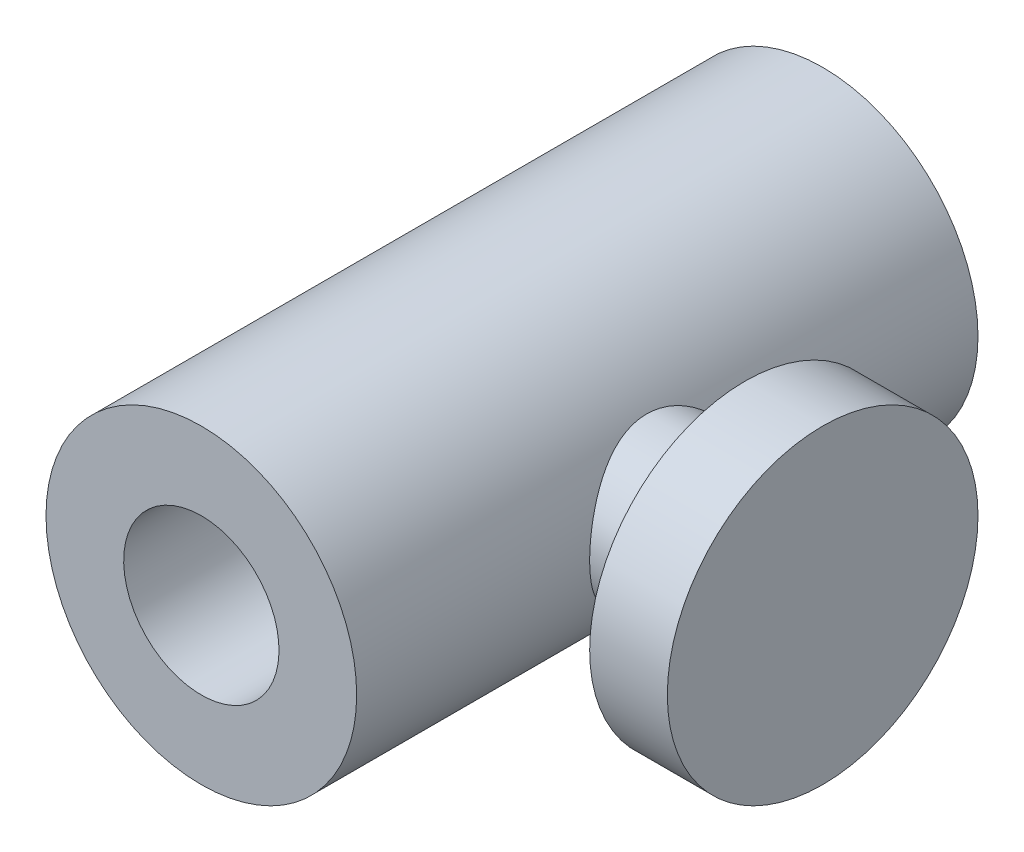
ISO-10303-21;
HEADER;
FILE_DESCRIPTION(('STEP AP214'),'2;1');
FILE_NAME('part.step','',(''),(''),'','','');
FILE_SCHEMA(('AUTOMOTIVE_DESIGN { 1 0 10303 214 1 1 1 1 }'));
ENDSEC;
DATA;
#1=APPLICATION_CONTEXT('core data for automotive mechanical design processes');
#2=APPLICATION_PROTOCOL_DEFINITION('international standard','automotive_design',2000,#1);
#3=PRODUCT_CONTEXT('',#1,'mechanical');
#4=PRODUCT('Part','Part','',(#3));
#5=PRODUCT_RELATED_PRODUCT_CATEGORY('part','',(#4));
#6=PRODUCT_DEFINITION_FORMATION('','',#4);
#7=PRODUCT_DEFINITION_CONTEXT('part definition',#1,'design');
#8=PRODUCT_DEFINITION('design','',#6,#7);
#9=PRODUCT_DEFINITION_SHAPE('','',#8);
#10=(LENGTH_UNIT() NAMED_UNIT(*) SI_UNIT(.MILLI.,.METRE.));
#11=(NAMED_UNIT(*) PLANE_ANGLE_UNIT() SI_UNIT($,.RADIAN.));
#12=(NAMED_UNIT(*) SI_UNIT($,.STERADIAN.) SOLID_ANGLE_UNIT());
#13=UNCERTAINTY_MEASURE_WITH_UNIT(LENGTH_MEASURE(1.E-05),#10,'distance_accuracy_value','');
#14=(GEOMETRIC_REPRESENTATION_CONTEXT(3) GLOBAL_UNCERTAINTY_ASSIGNED_CONTEXT((#13)) GLOBAL_UNIT_ASSIGNED_CONTEXT((#10,
#11,#12)) REPRESENTATION_CONTEXT('',''));
#15=CARTESIAN_POINT('',(0.,0.,0.));
#16=DIRECTION('',(0.,0.,1.));
#17=DIRECTION('',(1.,0.,0.));
#18=AXIS2_PLACEMENT_3D('',#15,#16,#17);
#19=CARTESIAN_POINT('',(0.,0.,40.));
#20=DIRECTION('',(0.,0.,-1.));
#21=DIRECTION('',(0.,1.,0.));
#22=AXIS2_PLACEMENT_3D('',#19,#20,#21);
#23=CYLINDRICAL_SURFACE('',#22,10.);
#24=CARTESIAN_POINT('',(8.66025403784439,5.,20.));
#25=CARTESIAN_POINT('',(8.66025482828519,4.99999937774203,20.1303316567961));
#26=CARTESIAN_POINT('',(8.66320639320551,4.99489703999514,20.2606749083469));
#27=CARTESIAN_POINT('',(8.67490215579888,4.97455590140419,20.5203552182528));
#28=CARTESIAN_POINT('',(8.68364905023327,4.95931238151411,20.6496917797997));
#29=CARTESIAN_POINT('',(8.70662912382781,4.91885673177676,20.9065135375637));
#30=CARTESIAN_POINT('',(8.72087090589728,4.89362896878987,21.033995503785));
#31=CARTESIAN_POINT('',(8.75432466229382,4.83352579766962,21.2860174644883));
#32=CARTESIAN_POINT('',(8.77353879767271,4.79864619425836,21.410556154035));
#33=CARTESIAN_POINT('',(8.83745677232208,4.6805346614708,21.7771112075341));
#34=CARTESIAN_POINT('',(8.88859880977519,4.58356144574886,22.0137323207336));
#35=CARTESIAN_POINT('',(9.00213659941723,4.35632594214356,22.4671619547889));
#36=CARTESIAN_POINT('',(9.06453296036386,4.22606185336434,22.6839694029475));
#37=CARTESIAN_POINT('',(9.19984032823,3.92334549410417,23.1115106177475));
#38=CARTESIAN_POINT('',(9.27319410334729,3.74829976483492,23.3202685823228));
#39=CARTESIAN_POINT('',(9.41860822234892,3.36622943427774,23.7070690515488));
#40=CARTESIAN_POINT('',(9.49066790509843,3.15918897852744,23.8850962349664));
#41=CARTESIAN_POINT('',(9.59484443095073,2.82033206345807,24.1312264286858));
#42=CARTESIAN_POINT('',(9.62993554487431,2.69838192133586,24.2119131521005));
#43=CARTESIAN_POINT('',(9.69680156689125,2.44722131237053,24.3626286654218));
#44=CARTESIAN_POINT('',(9.72857779329811,2.31801376345375,24.4326616973628));
#45=CARTESIAN_POINT('',(9.78789520431625,2.05317391777883,24.5613762312931));
#46=CARTESIAN_POINT('',(9.81543747951442,1.91754328730047,24.6200606574798));
#47=CARTESIAN_POINT('',(9.86547242365067,1.64079696990286,24.7254310158281));
#48=CARTESIAN_POINT('',(9.88796562891049,1.49968186742444,24.7721182224333));
#49=CARTESIAN_POINT('',(9.92580359946711,1.22330436599559,24.8500155125182));
#50=CARTESIAN_POINT('',(9.94154295735176,1.08833937324155,24.8820901096035));
#51=CARTESIAN_POINT('',(9.96761571585522,0.815709188800207,24.9349664286038));
#52=CARTESIAN_POINT('',(9.97794964280152,0.678044261360654,24.9557692480603));
#53=CARTESIAN_POINT('',(9.99290900237256,0.401217055741356,24.9858199114167));
#54=CARTESIAN_POINT('',(9.99753719051025,0.262055533104009,24.9950733329762));
#55=CARTESIAN_POINT('',(10.0009568128334,-0.016622041628071,25.0019143333983));
#56=CARTESIAN_POINT('',(9.99974860411976,-0.156138071510184,24.9995026259935));
#57=CARTESIAN_POINT('',(9.99189263105534,-0.422158287145518,24.9837693970487));
#58=CARTESIAN_POINT('',(9.9857287219252,-0.548735568605438,24.9714182292176));
#59=CARTESIAN_POINT('',(9.9687211507105,-0.800312348574872,24.937167427645));
#60=CARTESIAN_POINT('',(9.95787601100424,-0.925311336065691,24.915264778974));
#61=CARTESIAN_POINT('',(9.93176736436012,-1.17280363036129,24.8621537757626));
#62=CARTESIAN_POINT('',(9.91650533549045,-1.29529776073404,24.8309485341379));
#63=CARTESIAN_POINT('',(9.88192155120269,-1.53706747687734,24.7595523484822));
#64=CARTESIAN_POINT('',(9.86259824100145,-1.6563418102202,24.7193579627522));
#65=CARTESIAN_POINT('',(9.79859222392452,-2.01140340124728,24.5846254604358));
#66=CARTESIAN_POINT('',(9.74822622058318,-2.24122720645224,24.4766310411066));
#67=CARTESIAN_POINT('',(9.63687815372567,-2.67992393299637,24.2286703075067));
#68=CARTESIAN_POINT('',(9.57589229137331,-2.88878931500039,24.088692546844));
#69=CARTESIAN_POINT('',(9.44222356886893,-3.30085071454948,23.7655365262267));
#70=CARTESIAN_POINT('',(9.36897995679247,-3.50164452019891,23.5795253968794));
#71=CARTESIAN_POINT('',(9.22270586177088,-3.87054772569916,23.1770108060787));
#72=CARTESIAN_POINT('',(9.14967558498933,-4.03863197852248,22.9604841030917));
#73=CARTESIAN_POINT('',(9.04390911775424,-4.2679539578839,22.6088064627185));
#74=CARTESIAN_POINT('',(9.00829977481543,-4.34240098162072,22.4829490688498));
#75=CARTESIAN_POINT('',(8.94051483957134,-4.48030007564995,22.2244861217296));
#76=CARTESIAN_POINT('',(8.90833780331999,-4.54375677655288,22.0918834411214));
#77=CARTESIAN_POINT('',(8.84860631442917,-4.65901104656178,21.8207965096454));
#78=CARTESIAN_POINT('',(8.82104906525582,-4.71081567564999,21.6823158810192));
#79=CARTESIAN_POINT('',(8.7716484423619,-4.80217514780264,21.4003786539485));
#80=CARTESIAN_POINT('',(8.74980428958555,-4.84173166119403,21.2569227369748));
#81=CARTESIAN_POINT('',(8.71426171459812,-4.90539138118897,20.9777430649249));
#82=CARTESIAN_POINT('',(8.7000553284825,-4.93047005719824,20.8423062664424));
#83=CARTESIAN_POINT('',(8.67788216659552,-4.96939299432912,20.5693280921951));
#84=CARTESIAN_POINT('',(8.6699146257062,-4.98323863305272,20.4317869766089));
#85=CARTESIAN_POINT('',(8.66056020235632,-4.99947854378905,20.1558845075408));
#86=CARTESIAN_POINT('',(8.65916956150023,-5.00187935599941,20.01752366777));
#87=CARTESIAN_POINT('',(8.66301922537735,-4.99520900229025,19.7411790950675));
#88=CARTESIAN_POINT('',(8.66825908252539,-4.98613861072294,19.6031953373112));
#89=CARTESIAN_POINT('',(8.68421505193302,-4.95828928039379,19.3439119206006));
#90=CARTESIAN_POINT('',(8.69426699139328,-4.94068517767344,19.2224432856653));
#91=CARTESIAN_POINT('',(8.71910498639122,-4.89671673345791,18.9815824240837));
#92=CARTESIAN_POINT('',(8.7338925000332,-4.87034969372092,18.8621908489265));
#93=CARTESIAN_POINT('',(8.78469607426189,-4.77850297980869,18.5082899585571));
#94=CARTESIAN_POINT('',(8.82716454630259,-4.7002591459757,18.2778857081681));
#95=CARTESIAN_POINT('',(8.92681241600885,-4.50823244687956,17.8229067643173));
#96=CARTESIAN_POINT('',(8.98458205429472,-4.392971424463,17.5990963080479));
#97=CARTESIAN_POINT('',(9.10780608277643,-4.1314342135104,17.1726622544196));
#98=CARTESIAN_POINT('',(9.1732644129012,-3.9851420924436,16.9700496209225));
#99=CARTESIAN_POINT('',(9.31439795768908,-3.64419701683803,16.5651085963624));
#100=CARTESIAN_POINT('',(9.39032093861059,-3.44577250062108,16.3660355161201));
#101=CARTESIAN_POINT('',(9.53671997076951,-3.01697632238968,16.0029175331527));
#102=CARTESIAN_POINT('',(9.60719417697592,-2.78659391213232,15.8388844626049));
#103=CARTESIAN_POINT('',(9.70419418614479,-2.41774074756936,15.6209905262288));
#104=CARTESIAN_POINT('',(9.73542921288423,-2.28903769990884,15.5523379001797));
#105=CARTESIAN_POINT('',(9.79367711332059,-2.02535752273871,15.4262434813459));
#106=CARTESIAN_POINT('',(9.82069185600805,-1.89038320507347,15.3687967231238));
#107=CARTESIAN_POINT('',(9.86968940022035,-1.61516754079524,15.2657820915434));
#108=CARTESIAN_POINT('',(9.89167460130352,-1.47492874316051,15.2202085521106));
#109=CARTESIAN_POINT('',(9.92995088678441,-1.19024723850078,15.1414909239825));
#110=CARTESIAN_POINT('',(9.94624264638291,-1.04580503217188,15.1083453613854));
#111=CARTESIAN_POINT('',(9.97139931839171,-0.767401441682125,15.0574049663759));
#112=CARTESIAN_POINT('',(9.98080865626407,-0.633694933854981,15.0384803973572));
#113=CARTESIAN_POINT('',(9.99424478074505,-0.364924207537127,15.0115065468183));
#114=CARTESIAN_POINT('',(9.9982719832244,-0.229860094759434,15.0034564250429));
#115=CARTESIAN_POINT('',(10.0008314531461,0.0404881253987303,14.9983368228188));
#116=CARTESIAN_POINT('',(9.999365319798,0.175772157294896,15.0012641466371));
#117=CARTESIAN_POINT('',(9.99098333266103,0.445485239489126,15.0180525477526));
#118=CARTESIAN_POINT('',(9.98406762889855,0.579914313221437,15.0319133240524));
#119=CARTESIAN_POINT('',(9.96560870935097,0.83800421192803,15.0691176794173));
#120=CARTESIAN_POINT('',(9.95440210269674,0.961788818118176,15.0917728342268));
#121=CARTESIAN_POINT('',(9.92767317989821,1.20687032491423,15.1462131555377));
#122=CARTESIAN_POINT('',(9.91214948953036,1.32816642014825,15.1780012293566));
#123=CARTESIAN_POINT('',(9.859612953764,1.68709586409475,15.2866082442714));
#124=CARTESIAN_POINT('',(9.81661817605329,1.91998814282436,15.3767019250861));
#125=CARTESIAN_POINT('',(9.71629432734439,2.37715486497025,15.5936422217195));
#126=CARTESIAN_POINT('',(9.65843082383811,2.60063468941493,15.7218959654493));
#127=CARTESIAN_POINT('',(9.53440669320975,3.02386422902506,16.0097903051846));
#128=CARTESIAN_POINT('',(9.46824226032902,3.22360297720279,16.169445317032));
#129=CARTESIAN_POINT('',(9.32643278468726,3.61456788757425,16.5339751711068));
#130=CARTESIAN_POINT('',(9.25049954016331,3.80296860888285,16.7417690335459));
#131=CARTESIAN_POINT('',(9.1031442101187,4.14333626823684,17.1872970477145));
#132=CARTESIAN_POINT('',(9.03172615645363,4.29527097306548,17.4250574065678));
#133=CARTESIAN_POINT('',(8.93341291054548,4.49442606762734,17.8042196667176));
#134=CARTESIAN_POINT('',(8.90168698468314,4.55675683233958,17.936626328209));
#135=CARTESIAN_POINT('',(8.8428797220414,4.66985426801939,18.2072554637669));
#136=CARTESIAN_POINT('',(8.81579599491154,4.72062689492349,18.3454748987939));
#137=CARTESIAN_POINT('',(8.76742025858706,4.80987708806144,18.6264078742926));
#138=CARTESIAN_POINT('',(8.74611337114853,4.8483862843261,18.7691087930855));
#139=CARTESIAN_POINT('',(8.71014784774039,4.91270711070744,19.0580921444706));
#140=CARTESIAN_POINT('',(8.69548456411173,4.93852761851022,19.2043719976095));
#141=CARTESIAN_POINT('',(8.67647541111359,4.97182308032503,19.4589978869293));
#142=CARTESIAN_POINT('',(8.67040719452514,4.98237929832923,19.5668242162268));
#143=CARTESIAN_POINT('',(8.66229604436744,4.99646825199979,19.7830976599821));
#144=CARTESIAN_POINT('',(8.66025338008092,5.00000051781052,19.8915448154826));
#145=CARTESIAN_POINT('',(8.66025403784439,5.,20.));
#146=B_SPLINE_CURVE_WITH_KNOTS('',3,(#24,#25,#26,#27,#28,#29,#30,#31,#32,#33,#34,#35,#36,#37,
#38,#39,#40,#41,#42,#43,#44,#45,#46,#47,#48,#49,#50,#51,#52,#53,#54,#55,#56,#57,#58,#59,#60,#61,
#62,#63,#64,#65,#66,#67,#68,#69,#70,#71,#72,#73,#74,#75,#76,#77,#78,#79,#80,#81,#82,#83,#84,#85,
#86,#87,#88,#89,#90,#91,#92,#93,#94,#95,#96,#97,#98,#99,#100,#101,#102,#103,#104,#105,#106,#107,
#108,#109,#110,#111,#112,#113,#114,#115,#116,#117,#118,#119,#120,#121,#122,#123,#124,#125,#126,
#127,#128,#129,#130,#131,#132,#133,#134,#135,#136,#137,#138,#139,#140,#141,#142,#143,#144,#145),
.UNSPECIFIED.,.T.,.F.,(4,2,2,2,2,2,2,2,2,2,2,2,2,2,2,2,2,2,2,2,2,2,2,2,2,2,2,2,2,2,2,2,2,2,2,2,
2,2,2,2,2,2,2,2,2,2,2,2,2,2,2,2,2,2,2,2,2,2,2,2,4),(0.,0.390882384556485,0.781946787673771,
1.17362595011564,1.56547562833135,2.34415414386118,3.12287479153475,3.96582272680016,
4.80918971852754,5.25982992442625,5.71029022430251,6.16063429887937,6.61093051439736,
7.02920538093653,7.44743951241416,7.86547158389039,8.28347807833437,8.66500933177614,
9.04666110301431,9.42818530565609,9.80985583438833,10.5829669450729,11.3563551760292,
12.2028497813491,13.0499926207968,13.501002097322,13.9518210829089,14.4023661773263,
14.8528498019288,15.2676702585959,15.6824398346428,16.0969723603126,16.5114769048702,
16.8804871114428,17.2496110473149,17.9873544979167,18.759266696418,19.5315761871159,
20.4012390551442,21.2711951250237,21.7182117808489,22.1650299066984,22.6116344121698,
23.0581859356052,23.4637505264203,23.8692837779652,24.2746989806128,24.6801030225936,
25.0586722294313,25.4373620814588,26.1940875134848,26.9831783738578,27.7726323429201,
28.6406529303875,29.5094379801419,29.9581473751206,30.4066250230037,30.8539364017616,
31.3009343703532,31.626184479533,31.9514563450476),.UNSPECIFIED.);
#147=CARTESIAN_POINT('',(8.66025403784439,5.,20.));
#148=VERTEX_POINT('',#147);
#149=EDGE_CURVE('E10',#148,#148,#146,.T.);
#150=ORIENTED_EDGE('',*,*,#149,.F.);
#151=EDGE_LOOP('',(#150));
#152=FACE_BOUND('',#151,.T.);
#153=CARTESIAN_POINT('',(0.,0.,40.));
#154=DIRECTION('',(0.,0.,-1.));
#155=DIRECTION('',(0.,1.,0.));
#156=AXIS2_PLACEMENT_3D('',#153,#154,#155);
#157=CIRCLE('',#156,10.);
#158=CARTESIAN_POINT('',(0.,10.,40.));
#159=VERTEX_POINT('',#158);
#160=EDGE_CURVE('E45',#159,#159,#157,.T.);
#161=ORIENTED_EDGE('',*,*,#160,.T.);
#162=EDGE_LOOP('',(#161));
#163=FACE_BOUND('',#162,.T.);
#164=CARTESIAN_POINT('',(0.,0.,0.));
#165=DIRECTION('',(0.,0.,-1.));
#166=DIRECTION('',(0.,1.,0.));
#167=AXIS2_PLACEMENT_3D('',#164,#165,#166);
#168=CIRCLE('',#167,10.);
#169=CARTESIAN_POINT('',(0.,10.,0.));
#170=VERTEX_POINT('',#169);
#171=EDGE_CURVE('E41',#170,#170,#168,.T.);
#172=ORIENTED_EDGE('',*,*,#171,.F.);
#173=EDGE_LOOP('',(#172));
#174=FACE_BOUND('',#173,.T.);
#175=ADVANCED_FACE('F30',(#152,#163,#174),#23,.T.);
#176=CARTESIAN_POINT('',(0.,0.,0.));
#177=DIRECTION('',(0.,0.,-1.));
#178=DIRECTION('',(0.,1.,0.));
#179=AXIS2_PLACEMENT_3D('',#176,#177,#178);
#180=PLANE('',#179);
#181=CARTESIAN_POINT('',(0.,0.,0.));
#182=DIRECTION('',(0.,0.,-1.));
#183=DIRECTION('',(0.,1.,0.));
#184=AXIS2_PLACEMENT_3D('',#181,#182,#183);
#185=CIRCLE('',#184,4.99999999999999);
#186=CARTESIAN_POINT('',(0.,4.99999999999996,0.));
#187=VERTEX_POINT('',#186);
#188=EDGE_CURVE('E63',#187,#187,#185,.T.);
#189=ORIENTED_EDGE('',*,*,#188,.F.);
#190=EDGE_LOOP('',(#189));
#191=FACE_BOUND('',#190,.T.);
#192=ORIENTED_EDGE('',*,*,#171,.T.);
#193=EDGE_LOOP('',(#192));
#194=FACE_BOUND('',#193,.T.);
#195=ADVANCED_FACE('F69',(#191,#194),#180,.T.);
#196=CARTESIAN_POINT('',(10.,0.,40.));
#197=DIRECTION('',(0.,0.,1.));
#198=DIRECTION('',(0.,-1.,0.));
#199=AXIS2_PLACEMENT_3D('',#196,#197,#198);
#200=PLANE('',#199);
#201=CARTESIAN_POINT('',(0.,0.,40.));
#202=DIRECTION('',(0.,0.,-1.));
#203=DIRECTION('',(0.,1.,0.));
#204=AXIS2_PLACEMENT_3D('',#201,#202,#203);
#205=CIRCLE('',#204,4.99999999999998);
#206=CARTESIAN_POINT('',(0.,4.99999999999997,40.));
#207=VERTEX_POINT('',#206);
#208=EDGE_CURVE('E60',#207,#207,#205,.T.);
#209=ORIENTED_EDGE('',*,*,#208,.T.);
#210=EDGE_LOOP('',(#209));
#211=FACE_BOUND('',#210,.T.);
#212=ORIENTED_EDGE('',*,*,#160,.F.);
#213=EDGE_LOOP('',(#212));
#214=FACE_BOUND('',#213,.T.);
#215=ADVANCED_FACE('F71',(#211,#214),#200,.T.);
#216=CARTESIAN_POINT('',(20.,0.,20.));
#217=DIRECTION('',(1.,0.,0.));
#218=DIRECTION('',(0.,1.,0.));
#219=AXIS2_PLACEMENT_3D('',#216,#217,#218);
#220=PLANE('',#219);
#221=CARTESIAN_POINT('',(20.,0.,20.));
#222=DIRECTION('',(1.,0.,0.));
#223=DIRECTION('',(0.,1.,0.));
#224=AXIS2_PLACEMENT_3D('',#221,#222,#223);
#225=CIRCLE('',#224,10.);
#226=CARTESIAN_POINT('',(20.,10.,20.));
#227=VERTEX_POINT('',#226);
#228=EDGE_CURVE('E49',#227,#227,#225,.T.);
#229=ORIENTED_EDGE('',*,*,#228,.T.);
#230=EDGE_LOOP('',(#229));
#231=FACE_BOUND('',#230,.T.);
#232=ADVANCED_FACE('F76',(#231),#220,.T.);
#233=CARTESIAN_POINT('',(8.66025403784438,0.,20.));
#234=DIRECTION('',(1.,0.,0.));
#235=DIRECTION('',(0.,1.,0.));
#236=AXIS2_PLACEMENT_3D('',#233,#234,#235);
#237=CYLINDRICAL_SURFACE('',#236,10.);
#238=CARTESIAN_POINT('',(15.,0.,20.));
#239=DIRECTION('',(1.,0.,0.));
#240=DIRECTION('',(0.,1.,0.));
#241=AXIS2_PLACEMENT_3D('',#238,#239,#240);
#242=CIRCLE('',#241,10.);
#243=CARTESIAN_POINT('',(15.,10.,20.));
#244=VERTEX_POINT('',#243);
#245=EDGE_CURVE('E54',#244,#244,#242,.T.);
#246=ORIENTED_EDGE('',*,*,#245,.T.);
#247=EDGE_LOOP('',(#246));
#248=FACE_BOUND('',#247,.T.);
#249=ORIENTED_EDGE('',*,*,#228,.F.);
#250=EDGE_LOOP('',(#249));
#251=FACE_BOUND('',#250,.T.);
#252=ADVANCED_FACE('F83',(#248,#251),#237,.T.);
#253=CARTESIAN_POINT('',(15.,10.,20.));
#254=DIRECTION('',(-1.,0.,0.));
#255=DIRECTION('',(0.,-1.,0.));
#256=AXIS2_PLACEMENT_3D('',#253,#254,#255);
#257=PLANE('',#256);
#258=CARTESIAN_POINT('',(15.,0.,20.));
#259=DIRECTION('',(1.,0.,0.));
#260=DIRECTION('',(0.,1.,0.));
#261=AXIS2_PLACEMENT_3D('',#258,#259,#260);
#262=CIRCLE('',#261,5.);
#263=CARTESIAN_POINT('',(15.,5.,20.));
#264=VERTEX_POINT('',#263);
#265=EDGE_CURVE('E57',#264,#264,#262,.T.);
#266=ORIENTED_EDGE('',*,*,#265,.T.);
#267=EDGE_LOOP('',(#266));
#268=FACE_BOUND('',#267,.T.);
#269=ORIENTED_EDGE('',*,*,#245,.F.);
#270=EDGE_LOOP('',(#269));
#271=FACE_BOUND('',#270,.T.);
#272=ADVANCED_FACE('F87',(#268,#271),#257,.T.);
#273=CARTESIAN_POINT('',(8.66025403784438,0.,20.));
#274=DIRECTION('',(1.,0.,0.));
#275=DIRECTION('',(0.,1.,0.));
#276=AXIS2_PLACEMENT_3D('',#273,#274,#275);
#277=CYLINDRICAL_SURFACE('',#276,5.);
#278=ORIENTED_EDGE('',*,*,#149,.T.);
#279=EDGE_LOOP('',(#278));
#280=FACE_BOUND('',#279,.T.);
#281=ORIENTED_EDGE('',*,*,#265,.F.);
#282=EDGE_LOOP('',(#281));
#283=FACE_BOUND('',#282,.T.);
#284=ADVANCED_FACE('F90',(#280,#283),#277,.T.);
#285=CARTESIAN_POINT('',(0.,0.,0.));
#286=DIRECTION('',(0.,0.,-1.));
#287=DIRECTION('',(0.,1.,0.));
#288=AXIS2_PLACEMENT_3D('',#285,#286,#287);
#289=CYLINDRICAL_SURFACE('',#288,4.99999999999999);
#290=ORIENTED_EDGE('',*,*,#208,.F.);
#291=EDGE_LOOP('',(#290));
#292=FACE_BOUND('',#291,.T.);
#293=ORIENTED_EDGE('',*,*,#188,.T.);
#294=EDGE_LOOP('',(#293));
#295=FACE_BOUND('',#294,.T.);
#296=ADVANCED_FACE('F67',(#292,#295),#289,.F.);
#297=CLOSED_SHELL('',(#175,#195,#215,#232,#252,#272,#284,#296));
#298=MANIFOLD_SOLID_BREP('B2',#297);
#299=ADVANCED_BREP_SHAPE_REPRESENTATION('',(#18,#298),#14);
#300=SHAPE_DEFINITION_REPRESENTATION(#9,#299);
ENDSEC;
END-ISO-10303-21;
